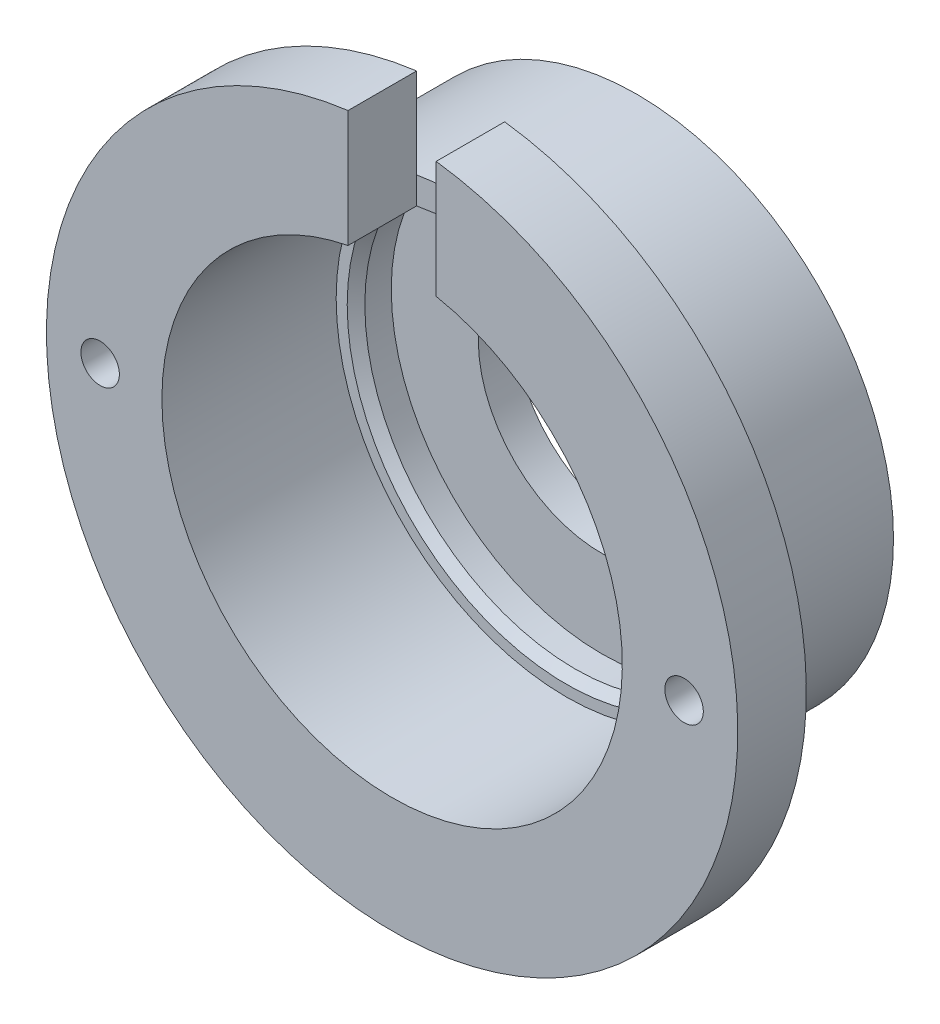
ISO-10303-21;
HEADER;
FILE_DESCRIPTION(('STEP AP214'),'2;1');
FILE_NAME('part.step','',(''),(''),'','','');
FILE_SCHEMA(('AUTOMOTIVE_DESIGN { 1 0 10303 214 1 1 1 1 }'));
ENDSEC;
DATA;
#1=APPLICATION_CONTEXT('core data for automotive mechanical design processes');
#2=APPLICATION_PROTOCOL_DEFINITION('international standard','automotive_design',2000,#1);
#3=PRODUCT_CONTEXT('',#1,'mechanical');
#4=PRODUCT('Part','Part','',(#3));
#5=PRODUCT_RELATED_PRODUCT_CATEGORY('part','',(#4));
#6=PRODUCT_DEFINITION_FORMATION('','',#4);
#7=PRODUCT_DEFINITION_CONTEXT('part definition',#1,'design');
#8=PRODUCT_DEFINITION('design','',#6,#7);
#9=PRODUCT_DEFINITION_SHAPE('','',#8);
#10=(LENGTH_UNIT() NAMED_UNIT(*) SI_UNIT(.MILLI.,.METRE.));
#11=(NAMED_UNIT(*) PLANE_ANGLE_UNIT() SI_UNIT($,.RADIAN.));
#12=(NAMED_UNIT(*) SI_UNIT($,.STERADIAN.) SOLID_ANGLE_UNIT());
#13=UNCERTAINTY_MEASURE_WITH_UNIT(LENGTH_MEASURE(1.E-05),#10,'distance_accuracy_value','');
#14=(GEOMETRIC_REPRESENTATION_CONTEXT(3) GLOBAL_UNCERTAINTY_ASSIGNED_CONTEXT((#13)) GLOBAL_UNIT_ASSIGNED_CONTEXT((#10,
#11,#12)) REPRESENTATION_CONTEXT('',''));
#15=CARTESIAN_POINT('',(0.,0.,0.));
#16=DIRECTION('',(0.,0.,1.));
#17=DIRECTION('',(1.,0.,0.));
#18=AXIS2_PLACEMENT_3D('',#15,#16,#17);
#19=CARTESIAN_POINT('',(0.,0.,-25.4112856059014));
#20=DIRECTION('',(0.,0.,-1.));
#21=DIRECTION('',(-1.,0.,0.));
#22=AXIS2_PLACEMENT_3D('',#19,#20,#21);
#23=CYLINDRICAL_SURFACE('',#22,19.6178195017485);
#24=CARTESIAN_POINT('',(0.,0.,5.29952653520657));
#25=DIRECTION('',(0.,0.,-1.));
#26=DIRECTION('',(-1.,0.,0.));
#27=AXIS2_PLACEMENT_3D('',#24,#25,#26);
#28=CIRCLE('',#27,19.6178195017485);
#29=CARTESIAN_POINT('',(-2.5,19.4578735221293,5.29952653520657));
#30=VERTEX_POINT('',#29);
#31=CARTESIAN_POINT('',(2.5,19.4578735221293,5.29952653520657));
#32=VERTEX_POINT('',#31);
#33=EDGE_CURVE('E135',#30,#32,#28,.F.);
#34=ORIENTED_EDGE('',*,*,#33,.T.);
#35=DIRECTION('',(0.,0.,-1.));
#36=VECTOR('',#35,1.);
#37=CARTESIAN_POINT('',(2.5,19.4578735221293,15.2995265352066));
#38=LINE('',#37,#36);
#39=CARTESIAN_POINT('',(2.5,19.4578735221293,9.18952653520657));
#40=VERTEX_POINT('',#39);
#41=EDGE_CURVE('E113',#40,#32,#38,.T.);
#42=ORIENTED_EDGE('',*,*,#41,.F.);
#43=CARTESIAN_POINT('',(0.,0.,9.18952653520658));
#44=DIRECTION('',(0.,0.,-1.));
#45=DIRECTION('',(-1.,0.,0.));
#46=AXIS2_PLACEMENT_3D('',#43,#44,#45);
#47=CIRCLE('',#46,19.6178195017485);
#48=CARTESIAN_POINT('',(-2.5,19.4578735221293,9.18952653520657));
#49=VERTEX_POINT('',#48);
#50=EDGE_CURVE('E152',#40,#49,#47,.T.);
#51=ORIENTED_EDGE('',*,*,#50,.T.);
#52=DIRECTION('',(0.,0.,-1.));
#53=VECTOR('',#52,1.);
#54=CARTESIAN_POINT('',(-2.5,19.4578735221293,15.2995265352066));
#55=LINE('',#54,#53);
#56=EDGE_CURVE('E60',#49,#30,#55,.T.);
#57=ORIENTED_EDGE('',*,*,#56,.T.);
#58=EDGE_LOOP('',(#34,#42,#51,#57));
#59=FACE_BOUND('',#58,.T.);
#60=ADVANCED_FACE('F37',(#59),#23,.T.);
#61=CARTESIAN_POINT('',(0.,0.,9.18952653520657));
#62=DIRECTION('',(0.,0.,-1.));
#63=DIRECTION('',(-1.,0.,0.));
#64=AXIS2_PLACEMENT_3D('',#61,#62,#63);
#65=PLANE('',#64);
#66=DIRECTION('',(0.,1.,0.));
#67=VECTOR('',#66,1.);
#68=CARTESIAN_POINT('',(2.49999999999999,0.,9.18952653520657));
#69=LINE('',#68,#67);
#70=CARTESIAN_POINT('',(2.49999999999999,12.8231931563658,9.18952653520658));
#71=VERTEX_POINT('',#70);
#72=EDGE_CURVE('E52',#71,#40,#69,.T.);
#73=ORIENTED_EDGE('',*,*,#72,.F.);
#74=CARTESIAN_POINT('',(0.,0.,9.18952653520658));
#75=DIRECTION('',(0.,0.,-1.));
#76=DIRECTION('',(-1.,0.,0.));
#77=AXIS2_PLACEMENT_3D('',#74,#75,#76);
#78=CIRCLE('',#77,13.0646195017485);
#79=CARTESIAN_POINT('',(-2.5,12.8231931563658,9.18952653520657));
#80=VERTEX_POINT('',#79);
#81=EDGE_CURVE('E106',#71,#80,#78,.T.);
#82=ORIENTED_EDGE('',*,*,#81,.T.);
#83=DIRECTION('',(0.,1.,0.));
#84=VECTOR('',#83,1.);
#85=CARTESIAN_POINT('',(-2.5,0.,9.18952653520657));
#86=LINE('',#85,#84);
#87=EDGE_CURVE('E115',#80,#49,#86,.T.);
#88=ORIENTED_EDGE('',*,*,#87,.T.);
#89=ORIENTED_EDGE('',*,*,#50,.F.);
#90=EDGE_LOOP('',(#73,#82,#88,#89));
#91=FACE_BOUND('',#90,.T.);
#92=CARTESIAN_POINT('',(-16.57,0.,9.18952653520658));
#93=DIRECTION('',(0.,0.,-1.));
#94=DIRECTION('',(-1.,0.,0.));
#95=AXIS2_PLACEMENT_3D('',#92,#93,#94);
#96=CIRCLE('',#95,1.0922);
#97=CARTESIAN_POINT('',(-17.6622,0.,9.18952653520658));
#98=VERTEX_POINT('',#97);
#99=EDGE_CURVE('E126',#98,#98,#96,.T.);
#100=ORIENTED_EDGE('',*,*,#99,.T.);
#101=EDGE_LOOP('',(#100));
#102=FACE_BOUND('',#101,.T.);
#103=CARTESIAN_POINT('',(16.57,0.,9.18952653520658));
#104=DIRECTION('',(0.,0.,-1.));
#105=DIRECTION('',(1.,0.,0.));
#106=AXIS2_PLACEMENT_3D('',#103,#104,#105);
#107=CIRCLE('',#106,1.0922);
#108=CARTESIAN_POINT('',(17.6622,0.,9.18952653520658));
#109=VERTEX_POINT('',#108);
#110=EDGE_CURVE('E120',#109,#109,#107,.T.);
#111=ORIENTED_EDGE('',*,*,#110,.T.);
#112=EDGE_LOOP('',(#111));
#113=FACE_BOUND('',#112,.T.);
#114=ADVANCED_FACE('F177',(#91,#102,#113),#65,.F.);
#115=CARTESIAN_POINT('',(0.,0.,5.29952653520657));
#116=DIRECTION('',(0.,0.,-1.));
#117=DIRECTION('',(-1.,0.,0.));
#118=AXIS2_PLACEMENT_3D('',#115,#116,#117);
#119=PLANE('',#118);
#120=CARTESIAN_POINT('',(0.,0.,5.29952653520657));
#121=DIRECTION('',(0.,0.,-1.));
#122=DIRECTION('',(-1.,0.,0.));
#123=AXIS2_PLACEMENT_3D('',#120,#121,#122);
#124=CIRCLE('',#123,14.565);
#125=CARTESIAN_POINT('',(2.5,14.3488405454936,5.29952653520657));
#126=VERTEX_POINT('',#125);
#127=CARTESIAN_POINT('',(-2.5,14.3488405454936,5.29952653520657));
#128=VERTEX_POINT('',#127);
#129=EDGE_CURVE('E136',#126,#128,#124,.T.);
#130=ORIENTED_EDGE('',*,*,#129,.F.);
#131=DIRECTION('',(0.,1.,0.));
#132=VECTOR('',#131,1.);
#133=CARTESIAN_POINT('',(2.49999999999999,0.,5.29952653520657));
#134=LINE('',#133,#132);
#135=EDGE_CURVE('E101',#126,#32,#134,.T.);
#136=ORIENTED_EDGE('',*,*,#135,.T.);
#137=ORIENTED_EDGE('',*,*,#33,.F.);
#138=DIRECTION('',(0.,1.,0.));
#139=VECTOR('',#138,1.);
#140=CARTESIAN_POINT('',(-2.5,0.,5.29952653520657));
#141=LINE('',#140,#139);
#142=EDGE_CURVE('E107',#128,#30,#141,.T.);
#143=ORIENTED_EDGE('',*,*,#142,.F.);
#144=EDGE_LOOP('',(#130,#136,#137,#143));
#145=FACE_BOUND('',#144,.T.);
#146=CARTESIAN_POINT('',(16.57,0.,5.29952653520657));
#147=DIRECTION('',(0.,0.,-1.));
#148=DIRECTION('',(1.,0.,0.));
#149=AXIS2_PLACEMENT_3D('',#146,#147,#148);
#150=CIRCLE('',#149,1.0922);
#151=CARTESIAN_POINT('',(17.6622,0.,5.29952653520657));
#152=VERTEX_POINT('',#151);
#153=EDGE_CURVE('E119',#152,#152,#150,.T.);
#154=ORIENTED_EDGE('',*,*,#153,.F.);
#155=EDGE_LOOP('',(#154));
#156=FACE_BOUND('',#155,.T.);
#157=CARTESIAN_POINT('',(-16.57,0.,5.29952653520657));
#158=DIRECTION('',(0.,0.,-1.));
#159=DIRECTION('',(-1.,0.,0.));
#160=AXIS2_PLACEMENT_3D('',#157,#158,#159);
#161=CIRCLE('',#160,1.0922);
#162=CARTESIAN_POINT('',(-17.6622,0.,5.29952653520657));
#163=VERTEX_POINT('',#162);
#164=EDGE_CURVE('E123',#163,#163,#161,.T.);
#165=ORIENTED_EDGE('',*,*,#164,.F.);
#166=EDGE_LOOP('',(#165));
#167=FACE_BOUND('',#166,.T.);
#168=ADVANCED_FACE('F183',(#145,#156,#167),#119,.T.);
#169=CARTESIAN_POINT('',(0.,0.,-4.70047346479343));
#170=DIRECTION('',(0.,0.,-1.));
#171=DIRECTION('',(-1.,0.,0.));
#172=AXIS2_PLACEMENT_3D('',#169,#170,#171);
#173=PLANE('',#172);
#174=CARTESIAN_POINT('',(0.,0.,-4.70047346479343));
#175=DIRECTION('',(0.,0.,-1.));
#176=DIRECTION('',(-1.,0.,0.));
#177=AXIS2_PLACEMENT_3D('',#174,#175,#176);
#178=CIRCLE('',#177,7.);
#179=CARTESIAN_POINT('',(-7.,0.,-4.70047346479343));
#180=VERTEX_POINT('',#179);
#181=EDGE_CURVE('E139',#180,#180,#178,.T.);
#182=ORIENTED_EDGE('',*,*,#181,.F.);
#183=EDGE_LOOP('',(#182));
#184=FACE_BOUND('',#183,.T.);
#185=CARTESIAN_POINT('',(0.,0.,-4.70047346479343));
#186=DIRECTION('',(0.,0.,-1.));
#187=DIRECTION('',(-1.,0.,0.));
#188=AXIS2_PLACEMENT_3D('',#185,#186,#187);
#189=CIRCLE('',#188,14.565);
#190=CARTESIAN_POINT('',(-14.565,0.,-4.70047346479343));
#191=VERTEX_POINT('',#190);
#192=EDGE_CURVE('E129',#191,#191,#189,.T.);
#193=ORIENTED_EDGE('',*,*,#192,.T.);
#194=EDGE_LOOP('',(#193));
#195=FACE_BOUND('',#194,.T.);
#196=ADVANCED_FACE('F187',(#184,#195),#173,.T.);
#197=CARTESIAN_POINT('',(0.,0.,-25.4112856059014));
#198=DIRECTION('',(0.,0.,-1.));
#199=DIRECTION('',(-1.,0.,0.));
#200=AXIS2_PLACEMENT_3D('',#197,#198,#199);
#201=CYLINDRICAL_SURFACE('',#200,13.0646195017485);
#202=ORIENTED_EDGE('',*,*,#81,.F.);
#203=DIRECTION('',(0.,0.,-1.));
#204=VECTOR('',#203,1.);
#205=CARTESIAN_POINT('',(2.49999999999999,12.8231931563658,-25.4112856059014));
#206=LINE('',#205,#204);
#207=CARTESIAN_POINT('',(2.49999999999999,12.8231931563658,5.29952653520657));
#208=VERTEX_POINT('',#207);
#209=EDGE_CURVE('E98',#71,#208,#206,.T.);
#210=ORIENTED_EDGE('',*,*,#209,.T.);
#211=CARTESIAN_POINT('',(0.,0.,5.29952653520657));
#212=DIRECTION('',(0.,0.,-1.));
#213=DIRECTION('',(-1.,0.,0.));
#214=AXIS2_PLACEMENT_3D('',#211,#212,#213);
#215=CIRCLE('',#214,13.0646195017485);
#216=CARTESIAN_POINT('',(-2.5,12.8231931563658,5.29952653520657));
#217=VERTEX_POINT('',#216);
#218=EDGE_CURVE('E85',#208,#217,#215,.F.);
#219=ORIENTED_EDGE('',*,*,#218,.T.);
#220=DIRECTION('',(0.,0.,-1.));
#221=VECTOR('',#220,1.);
#222=CARTESIAN_POINT('',(-2.5,12.8231931563658,-25.4112856059014));
#223=LINE('',#222,#221);
#224=EDGE_CURVE('E95',#217,#80,#223,.F.);
#225=ORIENTED_EDGE('',*,*,#224,.T.);
#226=EDGE_LOOP('',(#202,#210,#219,#225));
#227=FACE_BOUND('',#226,.T.);
#228=CARTESIAN_POINT('',(0.,0.,-0.70047346479343));
#229=DIRECTION('',(0.,0.,-1.));
#230=DIRECTION('',(-1.,0.,0.));
#231=AXIS2_PLACEMENT_3D('',#228,#229,#230);
#232=CIRCLE('',#231,13.0646195017485);
#233=CARTESIAN_POINT('',(-13.0646195017485,0.,-0.70047346479343));
#234=VERTEX_POINT('',#233);
#235=EDGE_CURVE('E148',#234,#234,#232,.T.);
#236=ORIENTED_EDGE('',*,*,#235,.T.);
#237=EDGE_LOOP('',(#236));
#238=FACE_BOUND('',#237,.T.);
#239=ADVANCED_FACE('F103',(#227,#238),#201,.F.);
#240=CARTESIAN_POINT('',(0.,0.,-0.700473464793428));
#241=DIRECTION('',(0.,0.,-1.));
#242=DIRECTION('',(-1.,0.,0.));
#243=AXIS2_PLACEMENT_3D('',#240,#241,#242);
#244=PLANE('',#243);
#245=CARTESIAN_POINT('',(0.,0.,-0.700473464793428));
#246=DIRECTION('',(0.,0.,-1.));
#247=DIRECTION('',(-1.,0.,0.));
#248=AXIS2_PLACEMENT_3D('',#245,#246,#247);
#249=CIRCLE('',#248,12.438);
#250=CARTESIAN_POINT('',(-12.438,0.,-0.700473464793428));
#251=VERTEX_POINT('',#250);
#252=EDGE_CURVE('E45',#251,#251,#249,.T.);
#253=ORIENTED_EDGE('',*,*,#252,.T.);
#254=EDGE_LOOP('',(#253));
#255=FACE_BOUND('',#254,.T.);
#256=ORIENTED_EDGE('',*,*,#235,.F.);
#257=EDGE_LOOP('',(#256));
#258=FACE_BOUND('',#257,.T.);
#259=ADVANCED_FACE('F159',(#255,#258),#244,.F.);
#260=CARTESIAN_POINT('',(0.,0.,-25.4112856059014));
#261=DIRECTION('',(0.,0.,-1.));
#262=DIRECTION('',(-1.,0.,0.));
#263=AXIS2_PLACEMENT_3D('',#260,#261,#262);
#264=CYLINDRICAL_SURFACE('',#263,11.938);
#265=CARTESIAN_POINT('',(0.,0.,-1.20047346479342));
#266=DIRECTION('',(0.,0.,-1.));
#267=DIRECTION('',(-1.,0.,0.));
#268=AXIS2_PLACEMENT_3D('',#265,#266,#267);
#269=CIRCLE('',#268,11.938);
#270=CARTESIAN_POINT('',(-11.938,0.,-1.20047346479342));
#271=VERTEX_POINT('',#270);
#272=EDGE_CURVE('E11',#271,#271,#269,.F.);
#273=ORIENTED_EDGE('',*,*,#272,.T.);
#274=EDGE_LOOP('',(#273));
#275=FACE_BOUND('',#274,.T.);
#276=CARTESIAN_POINT('',(0.,0.,-2.70047346479343));
#277=DIRECTION('',(0.,0.,-1.));
#278=DIRECTION('',(-1.,0.,0.));
#279=AXIS2_PLACEMENT_3D('',#276,#277,#278);
#280=CIRCLE('',#279,11.938);
#281=CARTESIAN_POINT('',(-11.938,0.,-2.70047346479343));
#282=VERTEX_POINT('',#281);
#283=EDGE_CURVE('E145',#282,#282,#280,.T.);
#284=ORIENTED_EDGE('',*,*,#283,.T.);
#285=EDGE_LOOP('',(#284));
#286=FACE_BOUND('',#285,.T.);
#287=ADVANCED_FACE('F219',(#275,#286),#264,.F.);
#288=CARTESIAN_POINT('',(0.,0.,-2.70047346479343));
#289=DIRECTION('',(0.,0.,-1.));
#290=DIRECTION('',(-1.,0.,0.));
#291=AXIS2_PLACEMENT_3D('',#288,#289,#290);
#292=PLANE('',#291);
#293=ORIENTED_EDGE('',*,*,#283,.F.);
#294=EDGE_LOOP('',(#293));
#295=FACE_BOUND('',#294,.T.);
#296=CARTESIAN_POINT('',(0.,0.,-2.70047346479343));
#297=DIRECTION('',(0.,0.,-1.));
#298=DIRECTION('',(-1.,0.,0.));
#299=AXIS2_PLACEMENT_3D('',#296,#297,#298);
#300=CIRCLE('',#299,7.);
#301=CARTESIAN_POINT('',(-7.,0.,-2.70047346479343));
#302=VERTEX_POINT('',#301);
#303=EDGE_CURVE('E142',#302,#302,#300,.T.);
#304=ORIENTED_EDGE('',*,*,#303,.T.);
#305=EDGE_LOOP('',(#304));
#306=FACE_BOUND('',#305,.T.);
#307=ADVANCED_FACE('F213',(#295,#306),#292,.F.);
#308=CARTESIAN_POINT('',(0.,0.,-25.4112856059014));
#309=DIRECTION('',(0.,0.,-1.));
#310=DIRECTION('',(-1.,0.,0.));
#311=AXIS2_PLACEMENT_3D('',#308,#309,#310);
#312=CYLINDRICAL_SURFACE('',#311,7.);
#313=ORIENTED_EDGE('',*,*,#303,.F.);
#314=EDGE_LOOP('',(#313));
#315=FACE_BOUND('',#314,.T.);
#316=ORIENTED_EDGE('',*,*,#181,.T.);
#317=EDGE_LOOP('',(#316));
#318=FACE_BOUND('',#317,.T.);
#319=ADVANCED_FACE('F203',(#315,#318),#312,.F.);
#320=CARTESIAN_POINT('',(0.,0.,5.29952653520657));
#321=DIRECTION('',(0.,0.,-1.));
#322=DIRECTION('',(-1.,0.,0.));
#323=AXIS2_PLACEMENT_3D('',#320,#321,#322);
#324=CYLINDRICAL_SURFACE('',#323,14.565);
#325=EDGE_CURVE('E132',#128,#126,#124,.T.);
#326=ORIENTED_EDGE('',*,*,#325,.T.);
#327=ORIENTED_EDGE('',*,*,#129,.T.);
#328=EDGE_LOOP('',(#326,#327));
#329=FACE_BOUND('',#328,.T.);
#330=ORIENTED_EDGE('',*,*,#192,.F.);
#331=EDGE_LOOP('',(#330));
#332=FACE_BOUND('',#331,.T.);
#333=ADVANCED_FACE('F201',(#329,#332),#324,.T.);
#334=CARTESIAN_POINT('',(-16.57,0.,9.18952653520658));
#335=DIRECTION('',(0.,0.,-1.));
#336=DIRECTION('',(-1.,0.,0.));
#337=AXIS2_PLACEMENT_3D('',#334,#335,#336);
#338=CYLINDRICAL_SURFACE('',#337,1.0922);
#339=ORIENTED_EDGE('',*,*,#99,.F.);
#340=EDGE_LOOP('',(#339));
#341=FACE_BOUND('',#340,.T.);
#342=ORIENTED_EDGE('',*,*,#164,.T.);
#343=EDGE_LOOP('',(#342));
#344=FACE_BOUND('',#343,.T.);
#345=ADVANCED_FACE('F172',(#341,#344),#338,.F.);
#346=CARTESIAN_POINT('',(16.57,0.,9.18952653520658));
#347=DIRECTION('',(0.,0.,-1.));
#348=DIRECTION('',(-1.,0.,0.));
#349=AXIS2_PLACEMENT_3D('',#346,#347,#348);
#350=CYLINDRICAL_SURFACE('',#349,1.0922);
#351=ORIENTED_EDGE('',*,*,#110,.F.);
#352=EDGE_LOOP('',(#351));
#353=FACE_BOUND('',#352,.T.);
#354=ORIENTED_EDGE('',*,*,#153,.T.);
#355=EDGE_LOOP('',(#354));
#356=FACE_BOUND('',#355,.T.);
#357=ADVANCED_FACE('F163',(#353,#356),#350,.F.);
#358=CARTESIAN_POINT('',(0.,0.,-0.70047346479343));
#359=DIRECTION('',(0.,0.,1.));
#360=DIRECTION('',(1.,0.,0.));
#361=AXIS2_PLACEMENT_3D('',#358,#359,#360);
#362=CONICAL_SURFACE('',#361,12.438,0.78539816339745);
#363=ORIENTED_EDGE('',*,*,#272,.F.);
#364=EDGE_LOOP('',(#363));
#365=FACE_BOUND('',#364,.T.);
#366=ORIENTED_EDGE('',*,*,#252,.F.);
#367=EDGE_LOOP('',(#366));
#368=FACE_BOUND('',#367,.T.);
#369=ADVANCED_FACE('F39',(#365,#368),#362,.F.);
#370=CARTESIAN_POINT('',(2.49999999999999,0.,15.2995265352066));
#371=DIRECTION('',(-1.,0.,0.));
#372=DIRECTION('',(0.,-1.,0.));
#373=AXIS2_PLACEMENT_3D('',#370,#371,#372);
#374=PLANE('',#373);
#375=ORIENTED_EDGE('',*,*,#72,.T.);
#376=ORIENTED_EDGE('',*,*,#41,.T.);
#377=ORIENTED_EDGE('',*,*,#135,.F.);
#378=DIRECTION('',(0.,1.,0.));
#379=VECTOR('',#378,1.);
#380=CARTESIAN_POINT('',(2.49999999999998,4.56499999999999,5.29952653520657));
#381=LINE('',#380,#379);
#382=EDGE_CURVE('E88',#208,#126,#381,.T.);
#383=ORIENTED_EDGE('',*,*,#382,.F.);
#384=ORIENTED_EDGE('',*,*,#209,.F.);
#385=EDGE_LOOP('',(#375,#376,#377,#383,#384));
#386=FACE_BOUND('',#385,.T.);
#387=ADVANCED_FACE('F97',(#386),#374,.T.);
#388=CARTESIAN_POINT('',(-2.5,0.,15.2995265352066));
#389=DIRECTION('',(-1.,0.,0.));
#390=DIRECTION('',(0.,0.,1.));
#391=AXIS2_PLACEMENT_3D('',#388,#389,#390);
#392=PLANE('',#391);
#393=ORIENTED_EDGE('',*,*,#87,.F.);
#394=ORIENTED_EDGE('',*,*,#224,.F.);
#395=DIRECTION('',(0.,1.,0.));
#396=VECTOR('',#395,1.);
#397=CARTESIAN_POINT('',(-2.50000000000002,4.565,5.29952653520657));
#398=LINE('',#397,#396);
#399=EDGE_CURVE('E91',#217,#128,#398,.T.);
#400=ORIENTED_EDGE('',*,*,#399,.T.);
#401=ORIENTED_EDGE('',*,*,#142,.T.);
#402=ORIENTED_EDGE('',*,*,#56,.F.);
#403=EDGE_LOOP('',(#393,#394,#400,#401,#402));
#404=FACE_BOUND('',#403,.T.);
#405=ADVANCED_FACE('F170',(#404),#392,.F.);
#406=CARTESIAN_POINT('',(2.49999999999998,4.56499999999999,5.29952653520657));
#407=DIRECTION('',(0.,0.,-1.));
#408=DIRECTION('',(-1.,0.,0.));
#409=AXIS2_PLACEMENT_3D('',#406,#407,#408);
#410=PLANE('',#409);
#411=ORIENTED_EDGE('',*,*,#382,.T.);
#412=ORIENTED_EDGE('',*,*,#325,.F.);
#413=ORIENTED_EDGE('',*,*,#399,.F.);
#414=ORIENTED_EDGE('',*,*,#218,.F.);
#415=EDGE_LOOP('',(#411,#412,#413,#414));
#416=FACE_BOUND('',#415,.T.);
#417=ADVANCED_FACE('F87',(#416),#410,.F.);
#418=CLOSED_SHELL('',(#60,#114,#168,#196,#239,#259,#287,#307,#319,#333,#345,#357,#369,#387,#405,#417));
#419=MANIFOLD_SOLID_BREP('B2',#418);
#420=ADVANCED_BREP_SHAPE_REPRESENTATION('',(#18,#419),#14);
#421=SHAPE_DEFINITION_REPRESENTATION(#9,#420);
ENDSEC;
END-ISO-10303-21;
